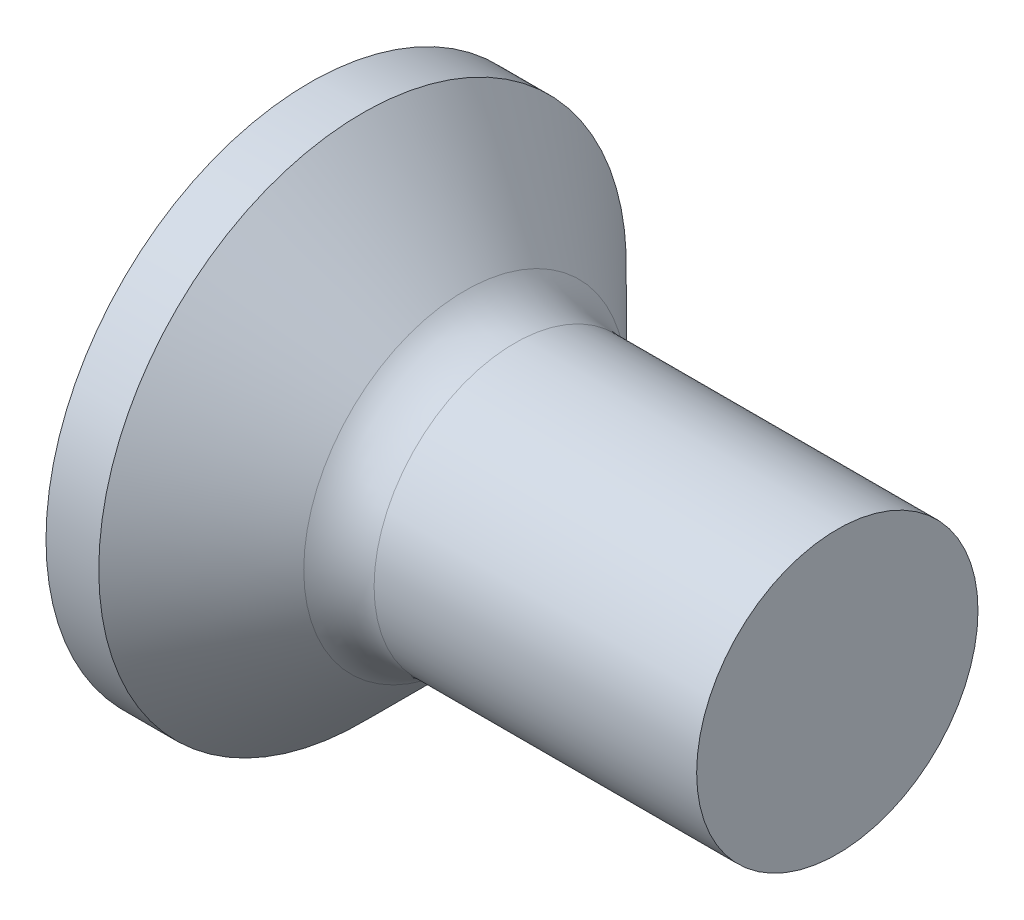
ISO-10303-21;
HEADER;
FILE_DESCRIPTION(('STEP AP214'),'2;1');
FILE_NAME('part.step','',(''),(''),'','','');
FILE_SCHEMA(('AUTOMOTIVE_DESIGN { 1 0 10303 214 1 1 1 1 }'));
ENDSEC;
DATA;
#1=APPLICATION_CONTEXT('core data for automotive mechanical design processes');
#2=APPLICATION_PROTOCOL_DEFINITION('international standard','automotive_design',2000,#1);
#3=PRODUCT_CONTEXT('',#1,'mechanical');
#4=PRODUCT('Part','Part','',(#3));
#5=PRODUCT_RELATED_PRODUCT_CATEGORY('part','',(#4));
#6=PRODUCT_DEFINITION_FORMATION('','',#4);
#7=PRODUCT_DEFINITION_CONTEXT('part definition',#1,'design');
#8=PRODUCT_DEFINITION('design','',#6,#7);
#9=PRODUCT_DEFINITION_SHAPE('','',#8);
#10=(LENGTH_UNIT() NAMED_UNIT(*) SI_UNIT(.MILLI.,.METRE.));
#11=(NAMED_UNIT(*) PLANE_ANGLE_UNIT() SI_UNIT($,.RADIAN.));
#12=(NAMED_UNIT(*) SI_UNIT($,.STERADIAN.) SOLID_ANGLE_UNIT());
#13=UNCERTAINTY_MEASURE_WITH_UNIT(LENGTH_MEASURE(1.E-05),#10,'distance_accuracy_value','');
#14=(GEOMETRIC_REPRESENTATION_CONTEXT(3) GLOBAL_UNCERTAINTY_ASSIGNED_CONTEXT((#13)) GLOBAL_UNIT_ASSIGNED_CONTEXT((#10,
#11,#12)) REPRESENTATION_CONTEXT('',''));
#15=CARTESIAN_POINT('',(0.,0.,0.));
#16=DIRECTION('',(0.,0.,1.));
#17=DIRECTION('',(1.,0.,0.));
#18=AXIS2_PLACEMENT_3D('',#15,#16,#17);
#19=CARTESIAN_POINT('',(3.0125,0.,0.));
#20=DIRECTION('',(-1.,0.,0.));
#21=DIRECTION('',(0.,-1.,0.));
#22=AXIS2_PLACEMENT_3D('',#19,#20,#21);
#23=SPHERICAL_SURFACE('',#22,3.0125);
#24=CARTESIAN_POINT('',(0.400000000000001,0.,0.));
#25=DIRECTION('',(-1.,0.,0.));
#26=DIRECTION('',(0.,0.,1.));
#27=AXIS2_PLACEMENT_3D('',#24,#25,#26);
#28=CIRCLE('',#27,1.5);
#29=CARTESIAN_POINT('',(0.400000000000001,0.,1.5));
#30=VERTEX_POINT('',#29);
#31=EDGE_CURVE('E223',#30,#30,#28,.T.);
#32=ORIENTED_EDGE('',*,*,#31,.T.);
#33=EDGE_LOOP('',(#32));
#34=FACE_BOUND('',#33,.T.);
#35=CARTESIAN_POINT('',(3.0125,0.24,0.));
#36=DIRECTION('',(0.,-1.,0.));
#37=DIRECTION('',(0.,0.,-1.));
#38=AXIS2_PLACEMENT_3D('',#35,#36,#37);
#39=CIRCLE('',#38,3.00292461610344);
#40=CARTESIAN_POINT('',(0.141276151234964,0.240000000000003,-0.879562311768129));
#41=VERTEX_POINT('',#40);
#42=CARTESIAN_POINT('',(0.0318913292717865,0.240000000000001,-0.365415109129042));
#43=VERTEX_POINT('',#42);
#44=EDGE_CURVE('E304',#41,#43,#39,.F.);
#45=ORIENTED_EDGE('',*,*,#44,.T.);
#46=CARTESIAN_POINT('',(0.0318913292717861,0.,0.));
#47=DIRECTION('',(1.,0.,0.));
#48=DIRECTION('',(0.,0.,-1.));
#49=AXIS2_PLACEMENT_3D('',#46,#47,#48);
#50=CIRCLE('',#49,0.437182115347586);
#51=CARTESIAN_POINT('',(0.0318913292717861,0.365415109129044,-0.24));
#52=VERTEX_POINT('',#51);
#53=EDGE_CURVE('E340',#43,#52,#50,.T.);
#54=ORIENTED_EDGE('',*,*,#53,.T.);
#55=CARTESIAN_POINT('',(3.0125,0.,-0.24));
#56=DIRECTION('',(0.,0.,1.));
#57=DIRECTION('',(1.,0.,0.));
#58=AXIS2_PLACEMENT_3D('',#55,#56,#57);
#59=CIRCLE('',#58,3.00292461610344);
#60=CARTESIAN_POINT('',(0.141276151234965,0.879562311768131,-0.24));
#61=VERTEX_POINT('',#60);
#62=EDGE_CURVE('E245',#52,#61,#59,.F.);
#63=ORIENTED_EDGE('',*,*,#62,.T.);
#64=CARTESIAN_POINT('',(2.79208577116727,-0.442082565577742,0.));
#65=DIRECTION('',(0.446197800778958,0.89493436774996,0.));
#66=DIRECTION('',(-0.89493436774996,0.446197800778958,0.));
#67=AXIS2_PLACEMENT_3D('',#64,#65,#66);
#68=CIRCLE('',#67,2.97172287115408);
#69=CARTESIAN_POINT('',(0.141276151234965,0.879562311768131,0.24));
#70=VERTEX_POINT('',#69);
#71=EDGE_CURVE('E249',#70,#61,#68,.F.);
#72=ORIENTED_EDGE('',*,*,#71,.F.);
#73=CARTESIAN_POINT('',(3.0125,0.,0.24));
#74=DIRECTION('',(0.,0.,-1.));
#75=DIRECTION('',(-1.,0.,0.));
#76=AXIS2_PLACEMENT_3D('',#73,#74,#75);
#77=CIRCLE('',#76,3.00292461610344);
#78=CARTESIAN_POINT('',(0.0318913292717861,0.365415109129044,0.239999999999999));
#79=VERTEX_POINT('',#78);
#80=EDGE_CURVE('E242',#70,#79,#77,.F.);
#81=ORIENTED_EDGE('',*,*,#80,.T.);
#82=CARTESIAN_POINT('',(0.0318913292717866,0.239999999999999,0.365415109129043));
#83=VERTEX_POINT('',#82);
#84=EDGE_CURVE('E478',#79,#83,#50,.T.);
#85=ORIENTED_EDGE('',*,*,#84,.T.);
#86=CARTESIAN_POINT('',(0.141276151234965,0.239999999999997,0.879562311768132));
#87=VERTEX_POINT('',#86);
#88=EDGE_CURVE('E271',#83,#87,#39,.F.);
#89=ORIENTED_EDGE('',*,*,#88,.T.);
#90=CARTESIAN_POINT('',(2.79208577116727,0.,-0.442082565577742));
#91=DIRECTION('',(0.446197800778958,0.,0.89493436774996));
#92=DIRECTION('',(0.89493436774996,0.,-0.446197800778958));
#93=AXIS2_PLACEMENT_3D('',#90,#91,#92);
#94=CIRCLE('',#93,2.97172287115408);
#95=CARTESIAN_POINT('',(0.141276151234965,-0.240000000000003,0.87956231176813));
#96=VERTEX_POINT('',#95);
#97=EDGE_CURVE('E43',#96,#87,#94,.F.);
#98=ORIENTED_EDGE('',*,*,#97,.F.);
#99=CARTESIAN_POINT('',(3.0125,-0.24,0.));
#100=DIRECTION('',(0.,1.,0.));
#101=DIRECTION('',(0.,0.,1.));
#102=AXIS2_PLACEMENT_3D('',#99,#100,#101);
#103=CIRCLE('',#102,3.00292461610344);
#104=CARTESIAN_POINT('',(0.0318913292717861,-0.240000000000001,0.365415109129042));
#105=VERTEX_POINT('',#104);
#106=EDGE_CURVE('E275',#96,#105,#103,.F.);
#107=ORIENTED_EDGE('',*,*,#106,.T.);
#108=CARTESIAN_POINT('',(0.0318913292717861,-0.365415109129044,0.239999999999999));
#109=VERTEX_POINT('',#108);
#110=EDGE_CURVE('E416',#105,#109,#50,.T.);
#111=ORIENTED_EDGE('',*,*,#110,.T.);
#112=CARTESIAN_POINT('',(0.141276151234965,-0.879562311768129,0.239999999999999));
#113=VERTEX_POINT('',#112);
#114=EDGE_CURVE('E241',#109,#113,#77,.F.);
#115=ORIENTED_EDGE('',*,*,#114,.T.);
#116=CARTESIAN_POINT('',(2.79208577116728,0.442082565577741,0.));
#117=DIRECTION('',(0.446197800778957,-0.894934367749961,0.));
#118=DIRECTION('',(0.894934367749961,0.446197800778957,0.));
#119=AXIS2_PLACEMENT_3D('',#116,#117,#118);
#120=CIRCLE('',#119,2.97172287115408);
#121=CARTESIAN_POINT('',(0.141276151234964,-0.87956231176813,-0.24));
#122=VERTEX_POINT('',#121);
#123=EDGE_CURVE('E239',#122,#113,#120,.F.);
#124=ORIENTED_EDGE('',*,*,#123,.F.);
#125=CARTESIAN_POINT('',(0.0318913292717861,-0.365415109129044,-0.24));
#126=VERTEX_POINT('',#125);
#127=EDGE_CURVE('E246',#122,#126,#59,.F.);
#128=ORIENTED_EDGE('',*,*,#127,.T.);
#129=CARTESIAN_POINT('',(0.0318913292717862,-0.239999999999998,-0.365415109129044));
#130=VERTEX_POINT('',#129);
#131=EDGE_CURVE('E370',#126,#130,#50,.T.);
#132=ORIENTED_EDGE('',*,*,#131,.T.);
#133=CARTESIAN_POINT('',(0.141276151234965,-0.239999999999996,-0.87956231176813));
#134=VERTEX_POINT('',#133);
#135=EDGE_CURVE('E277',#130,#134,#103,.F.);
#136=ORIENTED_EDGE('',*,*,#135,.T.);
#137=CARTESIAN_POINT('',(2.79208577116728,0.,0.442082565577741));
#138=DIRECTION('',(0.446197800778957,0.,-0.894934367749961));
#139=DIRECTION('',(-0.894934367749961,0.,-0.446197800778957));
#140=AXIS2_PLACEMENT_3D('',#137,#138,#139);
#141=CIRCLE('',#140,2.97172287115408);
#142=EDGE_CURVE('E252',#41,#134,#141,.F.);
#143=ORIENTED_EDGE('',*,*,#142,.F.);
#144=EDGE_LOOP('',(#45,#54,#63,#72,#81,#85,#89,#98,#107,#111,#115,#124,#128,#132,#136,#143));
#145=FACE_BOUND('',#144,.T.);
#146=ADVANCED_FACE('F35',(#34,#145),#23,.T.);
#147=CARTESIAN_POINT('',(1.2,0.35170209098021,-0.24));
#148=DIRECTION('',(0.,0.,1.));
#149=DIRECTION('',(1.,0.,0.));
#150=AXIS2_PLACEMENT_3D('',#147,#148,#149);
#151=PLANE('',#150);
#152=ORIENTED_EDGE('',*,*,#62,.F.);
#153=CARTESIAN_POINT('',(-0.628853174248477,0.419597308425255,-0.24));
#154=CARTESIAN_POINT('',(-0.496026090777525,0.408892887386583,-0.24));
#155=CARTESIAN_POINT('',(-0.363206299010612,0.398096148200659,-0.24));
#156=CARTESIAN_POINT('',(-0.0975846819099807,0.376245379346188,-0.24));
#157=CARTESIAN_POINT('',(0.0352171429135747,0.365191343482914,-0.24));
#158=CARTESIAN_POINT('',(0.300792988445544,0.342753840431149,-0.24));
#159=CARTESIAN_POINT('',(0.43356700916471,0.331370373370297,-0.24));
#160=CARTESIAN_POINT('',(0.699074117373212,0.308157520918687,-0.24));
#161=CARTESIAN_POINT('',(0.831807205486064,0.296328142696869,-0.24));
#162=CARTESIAN_POINT('',(1.05613666326034,0.275795773588708,-0.24));
#163=CARTESIAN_POINT('',(1.14774814832472,0.267258526170644,-0.24));
#164=CARTESIAN_POINT('',(1.33093167634579,0.249778869828352,-0.24));
#165=CARTESIAN_POINT('',(1.42250371964382,0.240836464484652,-0.24));
#166=CARTESIAN_POINT('',(1.60559944137136,0.222406513591782,-0.24));
#167=CARTESIAN_POINT('',(1.69712311652021,0.212918934916927,-0.24));
#168=CARTESIAN_POINT('',(1.88008018136455,0.193087178652668,-0.24));
#169=CARTESIAN_POINT('',(1.97151356797591,0.182742972761071,-0.24));
#170=CARTESIAN_POINT('',(2.06288061045409,0.171814774920692,-0.24));
#171=B_SPLINE_CURVE_WITH_KNOTS('',3,(#153,#154,#155,#156,#157,#158,#159,#160,#161,#162,#163,
#164,#165,#166,#167,#168,#169,#170),.UNSPECIFIED.,.F.,.F.,(4,2,2,2,2,2,2,2,4),(0.,
0.399773339064157,0.799556313129821,1.19933913230073,1.59911552687793,1.87514005059675,
2.15116213546319,2.42720100968592,2.70324900762613),.UNSPECIFIED.);
#172=CARTESIAN_POINT('',(1.2,0.262259890185287,-0.24));
#173=VERTEX_POINT('',#172);
#174=EDGE_CURVE('E393',#52,#173,#171,.T.);
#175=ORIENTED_EDGE('',*,*,#174,.T.);
#176=DIRECTION('',(0.,1.,0.));
#177=VECTOR('',#176,1.);
#178=CARTESIAN_POINT('',(1.2,-0.351702090980209,-0.24));
#179=LINE('',#178,#177);
#180=CARTESIAN_POINT('',(1.2,0.35170209098021,-0.24));
#181=VERTEX_POINT('',#180);
#182=EDGE_CURVE('E331',#173,#181,#179,.T.);
#183=ORIENTED_EDGE('',*,*,#182,.T.);
#184=DIRECTION('',(0.89493436774996,-0.446197800778958,0.));
#185=VECTOR('',#184,1.);
#186=CARTESIAN_POINT('',(0.,0.95,-0.24));
#187=LINE('',#186,#185);
#188=EDGE_CURVE('E220',#61,#181,#187,.T.);
#189=ORIENTED_EDGE('',*,*,#188,.F.);
#190=EDGE_LOOP('',(#152,#175,#183,#189));
#191=FACE_BOUND('',#190,.T.);
#192=ADVANCED_FACE('F188',(#191),#151,.T.);
#193=CARTESIAN_POINT('',(1.2,-0.351702090980209,-0.24));
#194=VERTEX_POINT('',#193);
#195=CARTESIAN_POINT('',(1.2,-0.262259890185287,-0.24));
#196=VERTEX_POINT('',#195);
#197=EDGE_CURVE('E229',#194,#196,#179,.T.);
#198=ORIENTED_EDGE('',*,*,#197,.T.);
#199=CARTESIAN_POINT('',(-0.628853174248477,-0.419597308425255,-0.24));
#200=CARTESIAN_POINT('',(-0.496026090777526,-0.408892887386583,-0.24));
#201=CARTESIAN_POINT('',(-0.363206299010612,-0.398096148200659,-0.24));
#202=CARTESIAN_POINT('',(-0.0975846819099812,-0.376245379346188,-0.24));
#203=CARTESIAN_POINT('',(0.0352171429135744,-0.365191343482914,-0.24));
#204=CARTESIAN_POINT('',(0.300792988445543,-0.342753840431149,-0.24));
#205=CARTESIAN_POINT('',(0.43356700916471,-0.331370373370297,-0.24));
#206=CARTESIAN_POINT('',(0.699074117373212,-0.308157520918687,-0.24));
#207=CARTESIAN_POINT('',(0.831807205486064,-0.296328142696869,-0.24));
#208=CARTESIAN_POINT('',(1.05613666326034,-0.275795773588708,-0.24));
#209=CARTESIAN_POINT('',(1.14774814832472,-0.267258526170644,-0.24));
#210=CARTESIAN_POINT('',(1.33093167634579,-0.249778869828352,-0.24));
#211=CARTESIAN_POINT('',(1.42250371964382,-0.240836464484651,-0.24));
#212=CARTESIAN_POINT('',(1.60559944137136,-0.222406513591782,-0.24));
#213=CARTESIAN_POINT('',(1.69712311652021,-0.212918934916927,-0.24));
#214=CARTESIAN_POINT('',(1.88008018136455,-0.193087178652668,-0.24));
#215=CARTESIAN_POINT('',(1.97151356797591,-0.182742972761071,-0.24));
#216=CARTESIAN_POINT('',(2.06288061045409,-0.171814774920692,-0.24));
#217=B_SPLINE_CURVE_WITH_KNOTS('',3,(#199,#200,#201,#202,#203,#204,#205,#206,#207,#208,#209,
#210,#211,#212,#213,#214,#215,#216),.UNSPECIFIED.,.F.,.F.,(4,2,2,2,2,2,2,2,4),(0.,
0.399773339064157,0.799556313129821,1.19933913230073,1.59911552687793,1.87514005059675,
2.15116213546319,2.42720100968592,2.70324900762613),.UNSPECIFIED.);
#218=EDGE_CURVE('E382',#196,#126,#217,.F.);
#219=ORIENTED_EDGE('',*,*,#218,.T.);
#220=ORIENTED_EDGE('',*,*,#127,.F.);
#221=DIRECTION('',(0.894934367749961,0.446197800778957,0.));
#222=VECTOR('',#221,1.);
#223=CARTESIAN_POINT('',(0.,-0.949999999999999,-0.24));
#224=LINE('',#223,#222);
#225=EDGE_CURVE('E58',#122,#194,#224,.T.);
#226=ORIENTED_EDGE('',*,*,#225,.T.);
#227=EDGE_LOOP('',(#198,#219,#220,#226));
#228=FACE_BOUND('',#227,.T.);
#229=ADVANCED_FACE('F194',(#228),#151,.T.);
#230=CARTESIAN_POINT('',(1.2,-0.351702090980209,0.24));
#231=DIRECTION('',(0.,0.,-1.));
#232=DIRECTION('',(-1.,0.,0.));
#233=AXIS2_PLACEMENT_3D('',#230,#231,#232);
#234=PLANE('',#233);
#235=DIRECTION('',(0.,-1.,0.));
#236=VECTOR('',#235,1.);
#237=CARTESIAN_POINT('',(1.2,0.351702090980209,0.24));
#238=LINE('',#237,#236);
#239=CARTESIAN_POINT('',(1.2,0.351702090980209,0.24));
#240=VERTEX_POINT('',#239);
#241=CARTESIAN_POINT('',(1.2,0.262259890185288,0.24));
#242=VERTEX_POINT('',#241);
#243=EDGE_CURVE('E315',#240,#242,#238,.T.);
#244=ORIENTED_EDGE('',*,*,#243,.T.);
#245=CARTESIAN_POINT('',(-0.628853174248477,0.419597308425256,0.239999999999999));
#246=CARTESIAN_POINT('',(-0.496026090777526,0.408892887386583,0.239999999999999));
#247=CARTESIAN_POINT('',(-0.363206299010612,0.398096148200659,0.239999999999999));
#248=CARTESIAN_POINT('',(-0.0975846819099812,0.376245379346189,0.239999999999999));
#249=CARTESIAN_POINT('',(0.0352171429135744,0.365191343482914,0.239999999999999));
#250=CARTESIAN_POINT('',(0.300792988445544,0.342753840431149,0.239999999999999));
#251=CARTESIAN_POINT('',(0.43356700916471,0.331370373370298,0.239999999999999));
#252=CARTESIAN_POINT('',(0.699074117373212,0.308157520918687,0.24));
#253=CARTESIAN_POINT('',(0.831807205486064,0.296328142696869,0.24));
#254=CARTESIAN_POINT('',(1.05613666326034,0.275795773588708,0.24));
#255=CARTESIAN_POINT('',(1.14774814832472,0.267258526170644,0.24));
#256=CARTESIAN_POINT('',(1.33093167634579,0.249778869828353,0.24));
#257=CARTESIAN_POINT('',(1.42250371964382,0.240836464484652,0.24));
#258=CARTESIAN_POINT('',(1.60559944137136,0.222406513591782,0.24));
#259=CARTESIAN_POINT('',(1.69712311652021,0.212918934916927,0.24));
#260=CARTESIAN_POINT('',(1.88008018136455,0.193087178652668,0.24));
#261=CARTESIAN_POINT('',(1.97151356797591,0.182742972761071,0.24));
#262=CARTESIAN_POINT('',(2.06288061045409,0.171814774920692,0.24));
#263=B_SPLINE_CURVE_WITH_KNOTS('',3,(#245,#246,#247,#248,#249,#250,#251,#252,#253,#254,#255,
#256,#257,#258,#259,#260,#261,#262),.UNSPECIFIED.,.F.,.F.,(4,2,2,2,2,2,2,2,4),(0.,
0.399773339064157,0.799556313129821,1.19933913230073,1.59911552687793,1.87514005059675,
2.15116213546319,2.42720100968592,2.70324900762613),.UNSPECIFIED.);
#264=EDGE_CURVE('E405',#242,#79,#263,.F.);
#265=ORIENTED_EDGE('',*,*,#264,.T.);
#266=ORIENTED_EDGE('',*,*,#80,.F.);
#267=DIRECTION('',(0.89493436774996,-0.446197800778958,0.));
#268=VECTOR('',#267,1.);
#269=CARTESIAN_POINT('',(0.,0.95,0.239999999999999));
#270=LINE('',#269,#268);
#271=EDGE_CURVE('E226',#70,#240,#270,.T.);
#272=ORIENTED_EDGE('',*,*,#271,.T.);
#273=EDGE_LOOP('',(#244,#265,#266,#272));
#274=FACE_BOUND('',#273,.T.);
#275=ADVANCED_FACE('F423',(#274),#234,.T.);
#276=ORIENTED_EDGE('',*,*,#114,.F.);
#277=CARTESIAN_POINT('',(-0.628853174248477,-0.419597308425256,0.239999999999999));
#278=CARTESIAN_POINT('',(-0.496026090777525,-0.408892887386583,0.239999999999999));
#279=CARTESIAN_POINT('',(-0.363206299010612,-0.398096148200659,0.239999999999999));
#280=CARTESIAN_POINT('',(-0.0975846819099809,-0.376245379346189,0.239999999999999));
#281=CARTESIAN_POINT('',(0.0352171429135746,-0.365191343482914,0.239999999999999));
#282=CARTESIAN_POINT('',(0.300792988445544,-0.342753840431149,0.239999999999999));
#283=CARTESIAN_POINT('',(0.43356700916471,-0.331370373370298,0.239999999999999));
#284=CARTESIAN_POINT('',(0.699074117373212,-0.308157520918687,0.24));
#285=CARTESIAN_POINT('',(0.831807205486064,-0.296328142696869,0.24));
#286=CARTESIAN_POINT('',(1.05613666326034,-0.275795773588708,0.24));
#287=CARTESIAN_POINT('',(1.14774814832472,-0.267258526170644,0.24));
#288=CARTESIAN_POINT('',(1.33093167634579,-0.249778869828353,0.24));
#289=CARTESIAN_POINT('',(1.42250371964382,-0.240836464484652,0.24));
#290=CARTESIAN_POINT('',(1.60559944137136,-0.222406513591782,0.24));
#291=CARTESIAN_POINT('',(1.69712311652021,-0.212918934916927,0.24));
#292=CARTESIAN_POINT('',(1.88008018136455,-0.193087178652668,0.24));
#293=CARTESIAN_POINT('',(1.97151356797591,-0.182742972761071,0.24));
#294=CARTESIAN_POINT('',(2.06288061045409,-0.171814774920692,0.24));
#295=B_SPLINE_CURVE_WITH_KNOTS('',3,(#277,#278,#279,#280,#281,#282,#283,#284,#285,#286,#287,
#288,#289,#290,#291,#292,#293,#294),.UNSPECIFIED.,.F.,.F.,(4,2,2,2,2,2,2,2,4),(0.,
0.399773339064157,0.799556313129821,1.19933913230073,1.59911552687793,1.87514005059675,
2.15116213546319,2.42720100968592,2.70324900762613),.UNSPECIFIED.);
#296=CARTESIAN_POINT('',(1.2,-0.262259890185288,0.24));
#297=VERTEX_POINT('',#296);
#298=EDGE_CURVE('E417',#109,#297,#295,.T.);
#299=ORIENTED_EDGE('',*,*,#298,.T.);
#300=CARTESIAN_POINT('',(1.2,-0.351702090980209,0.24));
#301=VERTEX_POINT('',#300);
#302=EDGE_CURVE('E317',#297,#301,#238,.T.);
#303=ORIENTED_EDGE('',*,*,#302,.T.);
#304=DIRECTION('',(0.894934367749961,0.446197800778957,0.));
#305=VECTOR('',#304,1.);
#306=CARTESIAN_POINT('',(0.,-0.949999999999999,0.239999999999999));
#307=LINE('',#306,#305);
#308=EDGE_CURVE('E308',#113,#301,#307,.T.);
#309=ORIENTED_EDGE('',*,*,#308,.F.);
#310=EDGE_LOOP('',(#276,#299,#303,#309));
#311=FACE_BOUND('',#310,.T.);
#312=ADVANCED_FACE('F427',(#311),#234,.T.);
#313=CARTESIAN_POINT('',(1.2,-0.351702090980209,-0.24));
#314=DIRECTION('',(1.,0.,0.));
#315=DIRECTION('',(0.,0.,-1.));
#316=AXIS2_PLACEMENT_3D('',#313,#314,#315);
#317=PLANE('',#316);
#318=CARTESIAN_POINT('',(1.2,0.,0.));
#319=DIRECTION('',(-1.,0.,0.));
#320=DIRECTION('',(0.,0.,1.));
#321=AXIS2_PLACEMENT_3D('',#318,#319,#320);
#322=CIRCLE('',#321,0.355499999999999);
#323=CARTESIAN_POINT('',(1.2,-0.0518255651213526,-0.35170209098021));
#324=VERTEX_POINT('',#323);
#325=CARTESIAN_POINT('',(1.2,-0.239999999999999,-0.262259890185289));
#326=VERTEX_POINT('',#325);
#327=EDGE_CURVE('E358',#324,#326,#322,.T.);
#328=ORIENTED_EDGE('',*,*,#327,.F.);
#329=DIRECTION('',(0.,-1.,0.));
#330=VECTOR('',#329,1.);
#331=CARTESIAN_POINT('',(1.2,0.240000000000001,-0.351702090980208));
#332=LINE('',#331,#330);
#333=CARTESIAN_POINT('',(1.2,-0.239999999999999,-0.35170209098021));
#334=VERTEX_POINT('',#333);
#335=EDGE_CURVE('E292',#324,#334,#332,.T.);
#336=ORIENTED_EDGE('',*,*,#335,.T.);
#337=DIRECTION('',(0.,0.,-1.));
#338=VECTOR('',#337,1.);
#339=CARTESIAN_POINT('',(1.2,-0.240000000000001,0.351702090980209));
#340=LINE('',#339,#338);
#341=EDGE_CURVE('E296',#326,#334,#340,.T.);
#342=ORIENTED_EDGE('',*,*,#341,.F.);
#343=EDGE_LOOP('',(#328,#336,#342));
#344=FACE_BOUND('',#343,.T.);
#345=ADVANCED_FACE('F436',(#344),#317,.F.);
#346=CARTESIAN_POINT('',(1.2,-0.351702090980209,-0.0518255651213541));
#347=VERTEX_POINT('',#346);
#348=EDGE_CURVE('E503',#196,#347,#322,.T.);
#349=ORIENTED_EDGE('',*,*,#348,.F.);
#350=ORIENTED_EDGE('',*,*,#197,.F.);
#351=DIRECTION('',(0.,0.,1.));
#352=VECTOR('',#351,1.);
#353=CARTESIAN_POINT('',(1.2,-0.351702090980209,-0.24));
#354=LINE('',#353,#352);
#355=EDGE_CURVE('E311',#194,#347,#354,.T.);
#356=ORIENTED_EDGE('',*,*,#355,.T.);
#357=EDGE_LOOP('',(#349,#350,#356));
#358=FACE_BOUND('',#357,.T.);
#359=ADVANCED_FACE('F439',(#358),#317,.F.);
#360=CARTESIAN_POINT('',(1.2,-0.351702090980209,0.0518255651213541));
#361=VERTEX_POINT('',#360);
#362=EDGE_CURVE('E498',#361,#297,#322,.T.);
#363=ORIENTED_EDGE('',*,*,#362,.F.);
#364=EDGE_CURVE('E314',#361,#301,#354,.T.);
#365=ORIENTED_EDGE('',*,*,#364,.T.);
#366=ORIENTED_EDGE('',*,*,#302,.F.);
#367=EDGE_LOOP('',(#363,#365,#366));
#368=FACE_BOUND('',#367,.T.);
#369=ADVANCED_FACE('F496',(#368),#317,.F.);
#370=CARTESIAN_POINT('',(1.2,-0.240000000000001,0.262259890185287));
#371=VERTEX_POINT('',#370);
#372=CARTESIAN_POINT('',(1.2,-0.0518255651213538,0.351702090980209));
#373=VERTEX_POINT('',#372);
#374=EDGE_CURVE('E508',#371,#373,#322,.T.);
#375=ORIENTED_EDGE('',*,*,#374,.F.);
#376=CARTESIAN_POINT('',(1.2,-0.240000000000001,0.351702090980209));
#377=VERTEX_POINT('',#376);
#378=EDGE_CURVE('E293',#377,#371,#340,.T.);
#379=ORIENTED_EDGE('',*,*,#378,.F.);
#380=DIRECTION('',(0.,1.,0.));
#381=VECTOR('',#380,1.);
#382=CARTESIAN_POINT('',(1.2,-0.240000000000001,0.351702090980209));
#383=LINE('',#382,#381);
#384=EDGE_CURVE('E297',#377,#373,#383,.T.);
#385=ORIENTED_EDGE('',*,*,#384,.T.);
#386=EDGE_LOOP('',(#375,#379,#385));
#387=FACE_BOUND('',#386,.T.);
#388=ADVANCED_FACE('F518',(#387),#317,.F.);
#389=CARTESIAN_POINT('',(1.2,0.0518255651213513,0.35170209098021));
#390=VERTEX_POINT('',#389);
#391=CARTESIAN_POINT('',(1.2,0.239999999999999,0.262259890185289));
#392=VERTEX_POINT('',#391);
#393=EDGE_CURVE('E359',#390,#392,#322,.T.);
#394=ORIENTED_EDGE('',*,*,#393,.F.);
#395=CARTESIAN_POINT('',(1.2,0.239999999999999,0.351702090980211));
#396=VERTEX_POINT('',#395);
#397=EDGE_CURVE('E300',#390,#396,#383,.T.);
#398=ORIENTED_EDGE('',*,*,#397,.T.);
#399=DIRECTION('',(0.,0.,1.));
#400=VECTOR('',#399,1.);
#401=CARTESIAN_POINT('',(1.2,0.240000000000001,-0.351702090980208));
#402=LINE('',#401,#400);
#403=EDGE_CURVE('E273',#392,#396,#402,.T.);
#404=ORIENTED_EDGE('',*,*,#403,.F.);
#405=EDGE_LOOP('',(#394,#398,#404));
#406=FACE_BOUND('',#405,.T.);
#407=ADVANCED_FACE('F515',(#406),#317,.F.);
#408=CARTESIAN_POINT('',(1.2,0.35170209098021,0.0518255651213526));
#409=VERTEX_POINT('',#408);
#410=EDGE_CURVE('E473',#242,#409,#322,.T.);
#411=ORIENTED_EDGE('',*,*,#410,.F.);
#412=ORIENTED_EDGE('',*,*,#243,.F.);
#413=DIRECTION('',(0.,0.,-1.));
#414=VECTOR('',#413,1.);
#415=CARTESIAN_POINT('',(1.2,0.351702090980209,0.24));
#416=LINE('',#415,#414);
#417=EDGE_CURVE('E318',#240,#409,#416,.T.);
#418=ORIENTED_EDGE('',*,*,#417,.T.);
#419=EDGE_LOOP('',(#411,#412,#418));
#420=FACE_BOUND('',#419,.T.);
#421=ADVANCED_FACE('F535',(#420),#317,.F.);
#422=CARTESIAN_POINT('',(1.2,0.35170209098021,-0.0518255651213526));
#423=VERTEX_POINT('',#422);
#424=EDGE_CURVE('E357',#423,#173,#322,.T.);
#425=ORIENTED_EDGE('',*,*,#424,.F.);
#426=EDGE_CURVE('E320',#423,#181,#416,.T.);
#427=ORIENTED_EDGE('',*,*,#426,.T.);
#428=ORIENTED_EDGE('',*,*,#182,.F.);
#429=EDGE_LOOP('',(#425,#427,#428));
#430=FACE_BOUND('',#429,.T.);
#431=ADVANCED_FACE('F474',(#430),#317,.F.);
#432=CARTESIAN_POINT('',(1.2,0.240000000000001,-0.262259890185287));
#433=VERTEX_POINT('',#432);
#434=CARTESIAN_POINT('',(1.2,0.0518255651213517,-0.351702090980209));
#435=VERTEX_POINT('',#434);
#436=EDGE_CURVE('E50',#433,#435,#322,.T.);
#437=ORIENTED_EDGE('',*,*,#436,.F.);
#438=CARTESIAN_POINT('',(1.2,0.240000000000001,-0.351702090980208));
#439=VERTEX_POINT('',#438);
#440=EDGE_CURVE('E301',#439,#433,#402,.T.);
#441=ORIENTED_EDGE('',*,*,#440,.F.);
#442=EDGE_CURVE('E289',#439,#435,#332,.T.);
#443=ORIENTED_EDGE('',*,*,#442,.T.);
#444=EDGE_LOOP('',(#437,#441,#443));
#445=FACE_BOUND('',#444,.T.);
#446=ADVANCED_FACE('F353',(#445),#317,.F.);
#447=CARTESIAN_POINT('',(0.,0.95,0.239999999999999));
#448=DIRECTION('',(0.446197800778958,0.89493436774996,0.));
#449=DIRECTION('',(-0.89493436774996,0.446197800778958,0.));
#450=AXIS2_PLACEMENT_3D('',#447,#448,#449);
#451=PLANE('',#450);
#452=CARTESIAN_POINT('',(1.81755030037572,0.0438028797890927,0.));
#453=DIRECTION('',(0.446197800778958,0.89493436774996,0.));
#454=DIRECTION('',(-0.89493436774996,0.446197800778958,0.));
#455=AXIS2_PLACEMENT_3D('',#452,#453,#454);
#456=ELLIPSE('',#455,0.699951178008361,0.309229710740658);
#457=EDGE_CURVE('E282',#409,#423,#456,.F.);
#458=ORIENTED_EDGE('',*,*,#457,.F.);
#459=ORIENTED_EDGE('',*,*,#417,.F.);
#460=ORIENTED_EDGE('',*,*,#271,.F.);
#461=ORIENTED_EDGE('',*,*,#71,.T.);
#462=ORIENTED_EDGE('',*,*,#188,.T.);
#463=ORIENTED_EDGE('',*,*,#426,.F.);
#464=EDGE_LOOP('',(#458,#459,#460,#461,#462,#463));
#465=FACE_BOUND('',#464,.T.);
#466=ADVANCED_FACE('F435',(#465),#451,.F.);
#467=CARTESIAN_POINT('',(1.2,-0.351702090980209,-0.24));
#468=DIRECTION('',(0.446197800778957,-0.894934367749961,0.));
#469=DIRECTION('',(0.894934367749961,0.446197800778957,0.));
#470=AXIS2_PLACEMENT_3D('',#467,#468,#469);
#471=PLANE('',#470);
#472=CARTESIAN_POINT('',(1.81755030037573,-0.0438028797890929,0.));
#473=DIRECTION('',(0.446197800778957,-0.894934367749961,0.));
#474=DIRECTION('',(-0.894934367749961,-0.446197800778957,0.));
#475=AXIS2_PLACEMENT_3D('',#472,#473,#474);
#476=ELLIPSE('',#475,0.699951178008362,0.309229710740658);
#477=EDGE_CURVE('E422',#347,#361,#476,.F.);
#478=ORIENTED_EDGE('',*,*,#477,.F.);
#479=ORIENTED_EDGE('',*,*,#355,.F.);
#480=ORIENTED_EDGE('',*,*,#225,.F.);
#481=ORIENTED_EDGE('',*,*,#123,.T.);
#482=ORIENTED_EDGE('',*,*,#308,.T.);
#483=ORIENTED_EDGE('',*,*,#364,.F.);
#484=EDGE_LOOP('',(#478,#479,#480,#481,#482,#483));
#485=FACE_BOUND('',#484,.T.);
#486=ADVANCED_FACE('F431',(#485),#471,.F.);
#487=CARTESIAN_POINT('',(1.2,-0.239999999999999,-0.35170209098021));
#488=DIRECTION('',(0.,1.,0.));
#489=DIRECTION('',(-1.,0.,0.));
#490=AXIS2_PLACEMENT_3D('',#487,#488,#489);
#491=PLANE('',#490);
#492=ORIENTED_EDGE('',*,*,#378,.T.);
#493=CARTESIAN_POINT('',(-0.628853174248477,-0.240000000000001,0.419597308425255));
#494=CARTESIAN_POINT('',(-0.496026090777525,-0.240000000000001,0.408892887386583));
#495=CARTESIAN_POINT('',(-0.363206299010612,-0.240000000000001,0.398096148200659));
#496=CARTESIAN_POINT('',(-0.0975846819099809,-0.240000000000001,0.376245379346188));
#497=CARTESIAN_POINT('',(0.0352171429135746,-0.240000000000001,0.365191343482913));
#498=CARTESIAN_POINT('',(0.300792988445544,-0.240000000000001,0.342753840431148));
#499=CARTESIAN_POINT('',(0.43356700916471,-0.240000000000001,0.331370373370297));
#500=CARTESIAN_POINT('',(0.699074117373212,-0.240000000000001,0.308157520918686));
#501=CARTESIAN_POINT('',(0.831807205486064,-0.240000000000001,0.296328142696868));
#502=CARTESIAN_POINT('',(1.05613666326034,-0.240000000000001,0.275795773588707));
#503=CARTESIAN_POINT('',(1.14774814832472,-0.240000000000001,0.267258526170643));
#504=CARTESIAN_POINT('',(1.33093167634579,-0.240000000000001,0.249778869828352));
#505=CARTESIAN_POINT('',(1.42250371964382,-0.240000000000001,0.240836464484651));
#506=CARTESIAN_POINT('',(1.60559944137136,-0.240000000000001,0.222406513591781));
#507=CARTESIAN_POINT('',(1.69712311652021,-0.240000000000001,0.212918934916926));
#508=CARTESIAN_POINT('',(1.88008018136455,-0.240000000000001,0.193087178652667));
#509=CARTESIAN_POINT('',(1.97151356797591,-0.240000000000001,0.18274297276107));
#510=CARTESIAN_POINT('',(2.06288061045409,-0.240000000000001,0.171814774920691));
#511=B_SPLINE_CURVE_WITH_KNOTS('',3,(#493,#494,#495,#496,#497,#498,#499,#500,#501,#502,#503,
#504,#505,#506,#507,#508,#509,#510),.UNSPECIFIED.,.F.,.F.,(4,2,2,2,2,2,2,2,4),(0.,
0.399773339064157,0.799556313129821,1.19933913230073,1.59911552687793,1.87514005059675,
2.15116213546319,2.42720100968592,2.70324900762613),.UNSPECIFIED.);
#512=EDGE_CURVE('E411',#371,#105,#511,.F.);
#513=ORIENTED_EDGE('',*,*,#512,.T.);
#514=ORIENTED_EDGE('',*,*,#106,.F.);
#515=DIRECTION('',(0.89493436774996,0.,-0.446197800778958));
#516=VECTOR('',#515,1.);
#517=CARTESIAN_POINT('',(0.,-0.240000000000003,0.95));
#518=LINE('',#517,#516);
#519=EDGE_CURVE('E265',#96,#377,#518,.T.);
#520=ORIENTED_EDGE('',*,*,#519,.T.);
#521=EDGE_LOOP('',(#492,#513,#514,#520));
#522=FACE_BOUND('',#521,.T.);
#523=ADVANCED_FACE('F372',(#522),#491,.T.);
#524=CARTESIAN_POINT('',(1.2,0.239999999999999,0.35170209098021));
#525=DIRECTION('',(0.,-1.,0.));
#526=DIRECTION('',(1.,0.,0.));
#527=AXIS2_PLACEMENT_3D('',#524,#525,#526);
#528=PLANE('',#527);
#529=ORIENTED_EDGE('',*,*,#88,.F.);
#530=CARTESIAN_POINT('',(-0.628853174255931,0.239999999999999,0.419597308425856));
#531=CARTESIAN_POINT('',(-0.496026090784187,0.239999999999999,0.408892887387124));
#532=CARTESIAN_POINT('',(-0.36320629901648,0.239999999999999,0.398096148201139));
#533=CARTESIAN_POINT('',(-0.0975846819142628,0.239999999999999,0.376245379346545));
#534=CARTESIAN_POINT('',(0.0352171429100857,0.239999999999999,0.365191343483207));
#535=CARTESIAN_POINT('',(0.300792988444603,0.239999999999999,0.342753840431231));
#536=CARTESIAN_POINT('',(0.433567009165524,0.239999999999999,0.33137037337023));
#537=CARTESIAN_POINT('',(0.699074117377535,0.239999999999999,0.308157520918307));
#538=CARTESIAN_POINT('',(0.831807205492141,0.239999999999999,0.296328142696326));
#539=CARTESIAN_POINT('',(1.05613666326817,0.239999999999999,0.275795773587983));
#540=CARTESIAN_POINT('',(1.14774814833255,0.239999999999999,0.267258526169909));
#541=CARTESIAN_POINT('',(1.33093167635362,0.239999999999999,0.249778869827595));
#542=CARTESIAN_POINT('',(1.42250371965165,0.239999999999999,0.24083646448388));
#543=CARTESIAN_POINT('',(1.60559944137918,0.239999999999999,0.222406513590979));
#544=CARTESIAN_POINT('',(1.69712311652803,0.239999999999999,0.212918934916105));
#545=CARTESIAN_POINT('',(1.88008018137237,0.239999999999999,0.193087178651798));
#546=CARTESIAN_POINT('',(1.97151356798372,0.239999999999999,0.182742972760172));
#547=CARTESIAN_POINT('',(2.0628806104619,0.239999999999999,0.171814774919755));
#548=B_SPLINE_CURVE_WITH_KNOTS('',3,(#530,#531,#532,#533,#534,#535,#536,#537,#538,#539,#540,
#541,#542,#543,#544,#545,#546,#547),.UNSPECIFIED.,.F.,.F.,(4,2,2,2,2,2,2,2,4),(0.,
0.399773339066543,0.799556313134594,1.19933913231079,1.59911552689327,1.87514005061209,
2.15116213547853,2.42720100970126,2.70324900764147),.UNSPECIFIED.);
#549=EDGE_CURVE('E400',#83,#392,#548,.T.);
#550=ORIENTED_EDGE('',*,*,#549,.T.);
#551=ORIENTED_EDGE('',*,*,#403,.T.);
#552=DIRECTION('',(0.89493436774996,0.,-0.446197800778958));
#553=VECTOR('',#552,1.);
#554=CARTESIAN_POINT('',(0.,0.239999999999997,0.950000000000001));
#555=LINE('',#554,#553);
#556=EDGE_CURVE('E263',#87,#396,#555,.T.);
#557=ORIENTED_EDGE('',*,*,#556,.F.);
#558=EDGE_LOOP('',(#529,#550,#551,#557));
#559=FACE_BOUND('',#558,.T.);
#560=ADVANCED_FACE('F269',(#559),#528,.T.);
#561=CARTESIAN_POINT('',(0.,-0.240000000000003,0.95));
#562=DIRECTION('',(0.446197800778958,0.,0.89493436774996));
#563=DIRECTION('',(-0.89493436774996,0.,0.446197800778958));
#564=AXIS2_PLACEMENT_3D('',#561,#562,#563);
#565=PLANE('',#564);
#566=CARTESIAN_POINT('',(1.81755030037572,0.,0.0438028797890927));
#567=DIRECTION('',(0.446197800778958,0.,0.89493436774996));
#568=DIRECTION('',(-0.89493436774996,0.,0.446197800778958));
#569=AXIS2_PLACEMENT_3D('',#566,#567,#568);
#570=ELLIPSE('',#569,0.699951178008361,0.309229710740658);
#571=EDGE_CURVE('E481',#373,#390,#570,.F.);
#572=ORIENTED_EDGE('',*,*,#571,.F.);
#573=ORIENTED_EDGE('',*,*,#384,.F.);
#574=ORIENTED_EDGE('',*,*,#519,.F.);
#575=ORIENTED_EDGE('',*,*,#97,.T.);
#576=ORIENTED_EDGE('',*,*,#556,.T.);
#577=ORIENTED_EDGE('',*,*,#397,.F.);
#578=EDGE_LOOP('',(#572,#573,#574,#575,#576,#577));
#579=FACE_BOUND('',#578,.T.);
#580=ADVANCED_FACE('F261',(#579),#565,.F.);
#581=ORIENTED_EDGE('',*,*,#440,.T.);
#582=CARTESIAN_POINT('',(-0.628853174255931,0.240000000000001,-0.419597308425855));
#583=CARTESIAN_POINT('',(-0.496026090784186,0.240000000000001,-0.408892887387122));
#584=CARTESIAN_POINT('',(-0.36320629901648,0.240000000000001,-0.398096148201138));
#585=CARTESIAN_POINT('',(-0.0975846819142626,0.240000000000001,-0.376245379346543));
#586=CARTESIAN_POINT('',(0.0352171429100858,0.240000000000001,-0.365191343483205));
#587=CARTESIAN_POINT('',(0.300792988444603,0.240000000000001,-0.34275384043123));
#588=CARTESIAN_POINT('',(0.433567009165525,0.240000000000001,-0.331370373370228));
#589=CARTESIAN_POINT('',(0.699074117377536,0.240000000000001,-0.308157520918305));
#590=CARTESIAN_POINT('',(0.831807205492142,0.240000000000001,-0.296328142696325));
#591=CARTESIAN_POINT('',(1.05613666326817,0.240000000000001,-0.275795773587981));
#592=CARTESIAN_POINT('',(1.14774814833255,0.240000000000001,-0.267258526169907));
#593=CARTESIAN_POINT('',(1.33093167635362,0.240000000000001,-0.249778869827593));
#594=CARTESIAN_POINT('',(1.42250371965165,0.240000000000001,-0.240836464483879));
#595=CARTESIAN_POINT('',(1.60559944137918,0.240000000000001,-0.222406513590977));
#596=CARTESIAN_POINT('',(1.69712311652803,0.240000000000001,-0.212918934916103));
#597=CARTESIAN_POINT('',(1.88008018137237,0.240000000000001,-0.193087178651796));
#598=CARTESIAN_POINT('',(1.97151356798372,0.240000000000001,-0.18274297276017));
#599=CARTESIAN_POINT('',(2.0628806104619,0.240000000000001,-0.171814774919753));
#600=B_SPLINE_CURVE_WITH_KNOTS('',3,(#582,#583,#584,#585,#586,#587,#588,#589,#590,#591,#592,
#593,#594,#595,#596,#597,#598,#599),.UNSPECIFIED.,.F.,.F.,(4,2,2,2,2,2,2,2,4),(0.,
0.399773339066543,0.799556313134594,1.19933913231079,1.59911552689327,1.87514005061209,
2.15116213547853,2.42720100970126,2.70324900764147),.UNSPECIFIED.);
#601=EDGE_CURVE('E347',#433,#43,#600,.F.);
#602=ORIENTED_EDGE('',*,*,#601,.T.);
#603=ORIENTED_EDGE('',*,*,#44,.F.);
#604=DIRECTION('',(0.894934367749961,0.,0.446197800778957));
#605=VECTOR('',#604,1.);
#606=CARTESIAN_POINT('',(0.,0.240000000000003,-0.949999999999998));
#607=LINE('',#606,#605);
#608=EDGE_CURVE('E279',#41,#439,#607,.T.);
#609=ORIENTED_EDGE('',*,*,#608,.T.);
#610=EDGE_LOOP('',(#581,#602,#603,#609));
#611=FACE_BOUND('',#610,.T.);
#612=ADVANCED_FACE('F345',(#611),#528,.T.);
#613=ORIENTED_EDGE('',*,*,#135,.F.);
#614=CARTESIAN_POINT('',(-0.628853174255931,-0.239999999999998,-0.419597308425857));
#615=CARTESIAN_POINT('',(-0.496026090784186,-0.239999999999998,-0.408892887387125));
#616=CARTESIAN_POINT('',(-0.36320629901648,-0.239999999999998,-0.39809614820114));
#617=CARTESIAN_POINT('',(-0.0975846819142632,-0.239999999999998,-0.376245379346545));
#618=CARTESIAN_POINT('',(0.0352171429100854,-0.239999999999998,-0.365191343483207));
#619=CARTESIAN_POINT('',(0.300792988444603,-0.239999999999998,-0.342753840431232));
#620=CARTESIAN_POINT('',(0.433567009165525,-0.239999999999998,-0.33137037337023));
#621=CARTESIAN_POINT('',(0.699074117377536,-0.239999999999999,-0.308157520918307));
#622=CARTESIAN_POINT('',(0.831807205492141,-0.239999999999999,-0.296328142696327));
#623=CARTESIAN_POINT('',(1.05613666326817,-0.239999999999999,-0.275795773587983));
#624=CARTESIAN_POINT('',(1.14774814833255,-0.239999999999999,-0.267258526169909));
#625=CARTESIAN_POINT('',(1.33093167635362,-0.239999999999999,-0.249778869827595));
#626=CARTESIAN_POINT('',(1.42250371965165,-0.239999999999999,-0.240836464483881));
#627=CARTESIAN_POINT('',(1.60559944137918,-0.239999999999999,-0.222406513590979));
#628=CARTESIAN_POINT('',(1.69712311652803,-0.239999999999999,-0.212918934916105));
#629=CARTESIAN_POINT('',(1.88008018137237,-0.239999999999999,-0.193087178651798));
#630=CARTESIAN_POINT('',(1.97151356798372,-0.239999999999999,-0.182742972760172));
#631=CARTESIAN_POINT('',(2.0628806104619,-0.239999999999999,-0.171814774919755));
#632=B_SPLINE_CURVE_WITH_KNOTS('',3,(#614,#615,#616,#617,#618,#619,#620,#621,#622,#623,#624,
#625,#626,#627,#628,#629,#630,#631),.UNSPECIFIED.,.F.,.F.,(4,2,2,2,2,2,2,2,4),(0.,
0.399773339066542,0.799556313134594,1.19933913231079,1.59911552689327,1.87514005061209,
2.15116213547853,2.42720100970126,2.70324900764147),.UNSPECIFIED.);
#633=EDGE_CURVE('E361',#130,#326,#632,.T.);
#634=ORIENTED_EDGE('',*,*,#633,.T.);
#635=ORIENTED_EDGE('',*,*,#341,.T.);
#636=DIRECTION('',(0.894934367749961,0.,0.446197800778957));
#637=VECTOR('',#636,1.);
#638=CARTESIAN_POINT('',(0.,-0.239999999999996,-0.95));
#639=LINE('',#638,#637);
#640=EDGE_CURVE('E286',#134,#334,#639,.T.);
#641=ORIENTED_EDGE('',*,*,#640,.F.);
#642=EDGE_LOOP('',(#613,#634,#635,#641));
#643=FACE_BOUND('',#642,.T.);
#644=ADVANCED_FACE('F212',(#643),#491,.T.);
#645=CARTESIAN_POINT('',(1.2,0.240000000000001,-0.351702090980208));
#646=DIRECTION('',(0.446197800778957,0.,-0.894934367749961));
#647=DIRECTION('',(0.894934367749961,0.,0.446197800778957));
#648=AXIS2_PLACEMENT_3D('',#645,#646,#647);
#649=PLANE('',#648);
#650=CARTESIAN_POINT('',(1.81755030037573,0.,-0.0438028797890929));
#651=DIRECTION('',(0.446197800778957,0.,-0.894934367749961));
#652=DIRECTION('',(-0.894934367749961,0.,-0.446197800778957));
#653=AXIS2_PLACEMENT_3D('',#650,#651,#652);
#654=ELLIPSE('',#653,0.699951178008362,0.309229710740658);
#655=EDGE_CURVE('E11',#435,#324,#654,.F.);
#656=ORIENTED_EDGE('',*,*,#655,.F.);
#657=ORIENTED_EDGE('',*,*,#442,.F.);
#658=ORIENTED_EDGE('',*,*,#608,.F.);
#659=ORIENTED_EDGE('',*,*,#142,.T.);
#660=ORIENTED_EDGE('',*,*,#640,.T.);
#661=ORIENTED_EDGE('',*,*,#335,.F.);
#662=EDGE_LOOP('',(#656,#657,#658,#659,#660,#661));
#663=FACE_BOUND('',#662,.T.);
#664=ADVANCED_FACE('F204',(#663),#649,.F.);
#665=CARTESIAN_POINT('',(3.4,0.,0.));
#666=DIRECTION('',(-1.,0.,0.));
#667=DIRECTION('',(0.,0.,1.));
#668=AXIS2_PLACEMENT_3D('',#665,#666,#667);
#669=PLANE('',#668);
#670=CARTESIAN_POINT('',(3.4,0.,0.));
#671=DIRECTION('',(-1.,0.,0.));
#672=DIRECTION('',(0.,0.,1.));
#673=AXIS2_PLACEMENT_3D('',#670,#671,#672);
#674=CIRCLE('',#673,0.8);
#675=CARTESIAN_POINT('',(3.4,0.,0.8));
#676=VERTEX_POINT('',#675);
#677=EDGE_CURVE('E217',#676,#676,#674,.T.);
#678=ORIENTED_EDGE('',*,*,#677,.F.);
#679=EDGE_LOOP('',(#678));
#680=FACE_BOUND('',#679,.T.);
#681=ADVANCED_FACE('F202',(#680),#669,.F.);
#682=CARTESIAN_POINT('',(-15.875,0.,0.));
#683=DIRECTION('',(-1.,0.,0.));
#684=DIRECTION('',(0.,0.,1.));
#685=AXIS2_PLACEMENT_3D('',#682,#683,#684);
#686=CYLINDRICAL_SURFACE('',#685,1.5);
#687=ORIENTED_EDGE('',*,*,#31,.F.);
#688=EDGE_LOOP('',(#687));
#689=FACE_BOUND('',#688,.T.);
#690=CARTESIAN_POINT('',(0.700000000000006,0.,0.));
#691=DIRECTION('',(-1.,0.,0.));
#692=DIRECTION('',(0.,0.,1.));
#693=AXIS2_PLACEMENT_3D('',#690,#691,#692);
#694=CIRCLE('',#693,1.5);
#695=CARTESIAN_POINT('',(0.700000000000006,0.,1.5));
#696=VERTEX_POINT('',#695);
#697=EDGE_CURVE('E219',#696,#696,#694,.T.);
#698=ORIENTED_EDGE('',*,*,#697,.T.);
#699=EDGE_LOOP('',(#698));
#700=FACE_BOUND('',#699,.T.);
#701=ADVANCED_FACE('F200',(#689,#700),#686,.T.);
#702=CARTESIAN_POINT('',(0.700000000000006,0.,0.));
#703=DIRECTION('',(-1.,0.,0.));
#704=DIRECTION('',(0.,0.,1.));
#705=AXIS2_PLACEMENT_3D('',#702,#703,#704);
#706=CONICAL_SURFACE('',#705,1.5,0.785398163397453);
#707=CARTESIAN_POINT('',(1.28284271247462,0.,0.));
#708=DIRECTION('',(1.,0.,0.));
#709=DIRECTION('',(0.,0.,-1.));
#710=AXIS2_PLACEMENT_3D('',#707,#708,#709);
#711=CIRCLE('',#710,0.917157287525383);
#712=CARTESIAN_POINT('',(1.28284271247462,0.,-0.917157287525383));
#713=VERTEX_POINT('',#712);
#714=EDGE_CURVE('E233',#713,#713,#711,.F.);
#715=ORIENTED_EDGE('',*,*,#714,.T.);
#716=EDGE_LOOP('',(#715));
#717=FACE_BOUND('',#716,.T.);
#718=ORIENTED_EDGE('',*,*,#697,.F.);
#719=EDGE_LOOP('',(#718));
#720=FACE_BOUND('',#719,.T.);
#721=ADVANCED_FACE('F210',(#717,#720),#706,.T.);
#722=CARTESIAN_POINT('',(-15.875,0.,0.));
#723=DIRECTION('',(-1.,0.,0.));
#724=DIRECTION('',(0.,0.,1.));
#725=AXIS2_PLACEMENT_3D('',#722,#723,#724);
#726=CYLINDRICAL_SURFACE('',#725,0.8);
#727=CARTESIAN_POINT('',(1.56568542494924,0.,0.));
#728=DIRECTION('',(-1.,0.,0.));
#729=DIRECTION('',(0.,0.,1.));
#730=AXIS2_PLACEMENT_3D('',#727,#728,#729);
#731=CIRCLE('',#730,0.8);
#732=CARTESIAN_POINT('',(1.56568542494924,0.,0.8));
#733=VERTEX_POINT('',#732);
#734=EDGE_CURVE('E236',#733,#733,#731,.F.);
#735=ORIENTED_EDGE('',*,*,#734,.T.);
#736=EDGE_LOOP('',(#735));
#737=FACE_BOUND('',#736,.T.);
#738=ORIENTED_EDGE('',*,*,#677,.T.);
#739=EDGE_LOOP('',(#738));
#740=FACE_BOUND('',#739,.T.);
#741=ADVANCED_FACE('F441',(#737,#740),#726,.T.);
#742=CARTESIAN_POINT('',(1.56568542494924,0.,0.));
#743=DIRECTION('',(-1.,0.,0.));
#744=DIRECTION('',(0.,0.,1.));
#745=AXIS2_PLACEMENT_3D('',#742,#743,#744);
#746=TOROIDAL_SURFACE('',#745,1.2,0.4);
#747=ORIENTED_EDGE('',*,*,#734,.F.);
#748=EDGE_LOOP('',(#747));
#749=FACE_BOUND('',#748,.T.);
#750=ORIENTED_EDGE('',*,*,#714,.F.);
#751=EDGE_LOOP('',(#750));
#752=FACE_BOUND('',#751,.T.);
#753=ADVANCED_FACE('F37',(#749,#752),#746,.F.);
#754=CARTESIAN_POINT('',(1.2,0.,0.));
#755=DIRECTION('',(-1.,0.,0.));
#756=DIRECTION('',(0.,0.,1.));
#757=AXIS2_PLACEMENT_3D('',#754,#755,#756);
#758=CONICAL_SURFACE('',#757,0.355499999999999,0.069813170079766);
#759=ORIENTED_EDGE('',*,*,#457,.T.);
#760=EDGE_CURVE('E468',#409,#423,#322,.T.);
#761=ORIENTED_EDGE('',*,*,#760,.F.);
#762=EDGE_LOOP('',(#759,#761));
#763=FACE_BOUND('',#762,.T.);
#764=ADVANCED_FACE('F185',(#763),#758,.F.);
#765=ORIENTED_EDGE('',*,*,#477,.T.);
#766=EDGE_CURVE('E505',#347,#361,#322,.T.);
#767=ORIENTED_EDGE('',*,*,#766,.F.);
#768=EDGE_LOOP('',(#765,#767));
#769=FACE_BOUND('',#768,.T.);
#770=ADVANCED_FACE('F458',(#769),#758,.F.);
#771=ORIENTED_EDGE('',*,*,#110,.F.);
#772=ORIENTED_EDGE('',*,*,#512,.F.);
#773=EDGE_CURVE('E506',#297,#371,#322,.T.);
#774=ORIENTED_EDGE('',*,*,#773,.F.);
#775=ORIENTED_EDGE('',*,*,#298,.F.);
#776=EDGE_LOOP('',(#771,#772,#774,#775));
#777=FACE_BOUND('',#776,.T.);
#778=ADVANCED_FACE('F464',(#777),#758,.F.);
#779=ORIENTED_EDGE('',*,*,#571,.T.);
#780=EDGE_CURVE('E363',#373,#390,#322,.T.);
#781=ORIENTED_EDGE('',*,*,#780,.F.);
#782=EDGE_LOOP('',(#779,#781));
#783=FACE_BOUND('',#782,.T.);
#784=ADVANCED_FACE('F522',(#783),#758,.F.);
#785=EDGE_CURVE('E362',#392,#242,#322,.T.);
#786=ORIENTED_EDGE('',*,*,#785,.F.);
#787=ORIENTED_EDGE('',*,*,#549,.F.);
#788=ORIENTED_EDGE('',*,*,#84,.F.);
#789=ORIENTED_EDGE('',*,*,#264,.F.);
#790=EDGE_LOOP('',(#786,#787,#788,#789));
#791=FACE_BOUND('',#790,.T.);
#792=ADVANCED_FACE('F526',(#791),#758,.F.);
#793=ORIENTED_EDGE('',*,*,#53,.F.);
#794=ORIENTED_EDGE('',*,*,#601,.F.);
#795=EDGE_CURVE('E354',#173,#433,#322,.T.);
#796=ORIENTED_EDGE('',*,*,#795,.F.);
#797=ORIENTED_EDGE('',*,*,#174,.F.);
#798=EDGE_LOOP('',(#793,#794,#796,#797));
#799=FACE_BOUND('',#798,.T.);
#800=ADVANCED_FACE('F530',(#799),#758,.F.);
#801=ORIENTED_EDGE('',*,*,#655,.T.);
#802=EDGE_CURVE('E355',#435,#324,#322,.T.);
#803=ORIENTED_EDGE('',*,*,#802,.F.);
#804=EDGE_LOOP('',(#801,#803));
#805=FACE_BOUND('',#804,.T.);
#806=ADVANCED_FACE('F182',(#805),#758,.F.);
#807=EDGE_CURVE('E504',#326,#196,#322,.T.);
#808=ORIENTED_EDGE('',*,*,#807,.F.);
#809=ORIENTED_EDGE('',*,*,#633,.F.);
#810=ORIENTED_EDGE('',*,*,#131,.F.);
#811=ORIENTED_EDGE('',*,*,#218,.F.);
#812=EDGE_LOOP('',(#808,#809,#810,#811));
#813=FACE_BOUND('',#812,.T.);
#814=ADVANCED_FACE('F177',(#813),#758,.F.);
#815=CARTESIAN_POINT('',(1.31550895201079,0.,0.));
#816=DIRECTION('',(-1.,0.,0.));
#817=DIRECTION('',(0.,0.,1.));
#818=AXIS2_PLACEMENT_3D('',#815,#816,#817);
#819=CONICAL_SURFACE('',#818,0.,1.25663706143592);
#820=ORIENTED_EDGE('',*,*,#393,.T.);
#821=ORIENTED_EDGE('',*,*,#785,.T.);
#822=ORIENTED_EDGE('',*,*,#410,.T.);
#823=ORIENTED_EDGE('',*,*,#760,.T.);
#824=ORIENTED_EDGE('',*,*,#424,.T.);
#825=ORIENTED_EDGE('',*,*,#795,.T.);
#826=ORIENTED_EDGE('',*,*,#436,.T.);
#827=ORIENTED_EDGE('',*,*,#802,.T.);
#828=ORIENTED_EDGE('',*,*,#327,.T.);
#829=ORIENTED_EDGE('',*,*,#807,.T.);
#830=ORIENTED_EDGE('',*,*,#348,.T.);
#831=ORIENTED_EDGE('',*,*,#766,.T.);
#832=ORIENTED_EDGE('',*,*,#362,.T.);
#833=ORIENTED_EDGE('',*,*,#773,.T.);
#834=ORIENTED_EDGE('',*,*,#374,.T.);
#835=ORIENTED_EDGE('',*,*,#780,.T.);
#836=EDGE_LOOP('',(#820,#821,#822,#823,#824,#825,#826,#827,#828,#829,#830,#831,#832,#833,#834,#835));
#837=FACE_BOUND('',#836,.T.);
#838=CARTESIAN_POINT('',(1.31550895201079,0.,0.));
#839=VERTEX_POINT('',#838);
#840=VERTEX_LOOP('',#839);
#841=FACE_BOUND('',#840,.T.);
#842=ADVANCED_FACE('F175',(#837,#841),#819,.F.);
#843=CLOSED_SHELL('',(#146,#192,#229,#275,#312,#345,#359,#369,#388,#407,#421,#431,#446,#466,
#486,#523,#560,#580,#612,#644,#664,#681,#701,#721,#741,#753,#764,#770,#778,#784,#792,#800,#806,
#814,#842));
#844=MANIFOLD_SOLID_BREP('B2',#843);
#845=ADVANCED_BREP_SHAPE_REPRESENTATION('',(#18,#844),#14);
#846=SHAPE_DEFINITION_REPRESENTATION(#9,#845);
ENDSEC;
END-ISO-10303-21;
